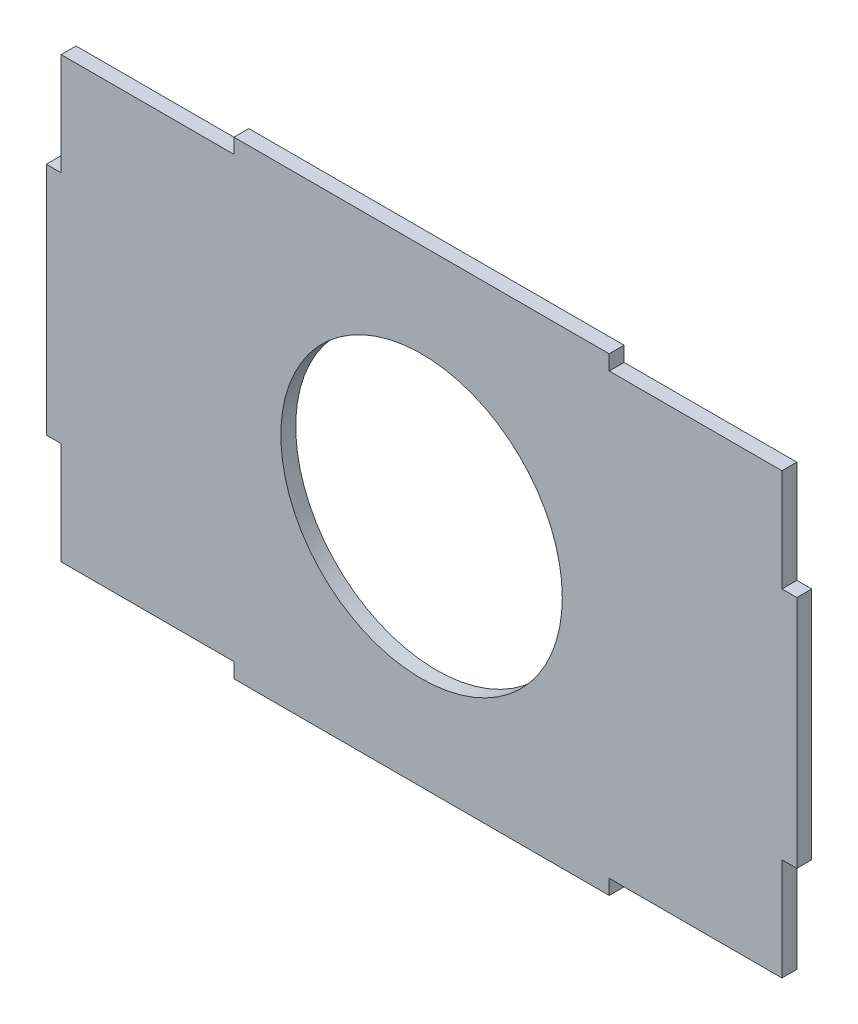
ISO-10303-21;
HEADER;
FILE_DESCRIPTION(('STEP AP214'),'2;1');
FILE_NAME('part.step','',(''),(''),'','','');
FILE_SCHEMA(('AUTOMOTIVE_DESIGN { 1 0 10303 214 1 1 1 1 }'));
ENDSEC;
DATA;
#1=APPLICATION_CONTEXT('core data for automotive mechanical design processes');
#2=APPLICATION_PROTOCOL_DEFINITION('international standard','automotive_design',2000,#1);
#3=PRODUCT_CONTEXT('',#1,'mechanical');
#4=PRODUCT('Part','Part','',(#3));
#5=PRODUCT_RELATED_PRODUCT_CATEGORY('part','',(#4));
#6=PRODUCT_DEFINITION_FORMATION('','',#4);
#7=PRODUCT_DEFINITION_CONTEXT('part definition',#1,'design');
#8=PRODUCT_DEFINITION('design','',#6,#7);
#9=PRODUCT_DEFINITION_SHAPE('','',#8);
#10=(LENGTH_UNIT() NAMED_UNIT(*) SI_UNIT(.MILLI.,.METRE.));
#11=(NAMED_UNIT(*) PLANE_ANGLE_UNIT() SI_UNIT($,.RADIAN.));
#12=(NAMED_UNIT(*) SI_UNIT($,.STERADIAN.) SOLID_ANGLE_UNIT());
#13=UNCERTAINTY_MEASURE_WITH_UNIT(LENGTH_MEASURE(1.E-05),#10,'distance_accuracy_value','');
#14=(GEOMETRIC_REPRESENTATION_CONTEXT(3) GLOBAL_UNCERTAINTY_ASSIGNED_CONTEXT((#13)) GLOBAL_UNIT_ASSIGNED_CONTEXT((#10,
#11,#12)) REPRESENTATION_CONTEXT('',''));
#15=CARTESIAN_POINT('',(0.,0.,0.));
#16=DIRECTION('',(0.,0.,1.));
#17=DIRECTION('',(1.,0.,0.));
#18=AXIS2_PLACEMENT_3D('',#15,#16,#17);
#19=CARTESIAN_POINT('',(-40.,96.825,3.175));
#20=DIRECTION('',(1.,0.,0.));
#21=DIRECTION('',(0.,1.,0.));
#22=AXIS2_PLACEMENT_3D('',#19,#20,#21);
#23=PLANE('',#22);
#24=DIRECTION('',(0.,-1.,0.));
#25=VECTOR('',#24,1.);
#26=CARTESIAN_POINT('',(-40.,96.825,0.));
#27=LINE('',#26,#25);
#28=CARTESIAN_POINT('',(-40.,100.,0.));
#29=VERTEX_POINT('',#28);
#30=CARTESIAN_POINT('',(-40.,96.825,0.));
#31=VERTEX_POINT('',#30);
#32=EDGE_CURVE('E201',#29,#31,#27,.T.);
#33=ORIENTED_EDGE('',*,*,#32,.T.);
#34=DIRECTION('',(0.,0.,-1.));
#35=VECTOR('',#34,1.);
#36=CARTESIAN_POINT('',(-40.,96.825,3.175));
#37=LINE('',#36,#35);
#38=CARTESIAN_POINT('',(-40.,96.825,3.175));
#39=VERTEX_POINT('',#38);
#40=EDGE_CURVE('E11',#39,#31,#37,.T.);
#41=ORIENTED_EDGE('',*,*,#40,.F.);
#42=DIRECTION('',(0.,-1.,0.));
#43=VECTOR('',#42,1.);
#44=CARTESIAN_POINT('',(-40.,96.825,3.175));
#45=LINE('',#44,#43);
#46=CARTESIAN_POINT('',(-40.,100.,3.175));
#47=VERTEX_POINT('',#46);
#48=EDGE_CURVE('E240',#47,#39,#45,.T.);
#49=ORIENTED_EDGE('',*,*,#48,.F.);
#50=DIRECTION('',(0.,0.,-1.));
#51=VECTOR('',#50,1.);
#52=CARTESIAN_POINT('',(-40.,100.,3.175));
#53=LINE('',#52,#51);
#54=EDGE_CURVE('E197',#47,#29,#53,.T.);
#55=ORIENTED_EDGE('',*,*,#54,.T.);
#56=EDGE_LOOP('',(#33,#41,#49,#55));
#57=FACE_BOUND('',#56,.T.);
#58=ADVANCED_FACE('F33',(#57),#23,.F.);
#59=CARTESIAN_POINT('',(-76.825,96.825,3.175));
#60=DIRECTION('',(0.,-1.,0.));
#61=DIRECTION('',(1.,0.,0.));
#62=AXIS2_PLACEMENT_3D('',#59,#60,#61);
#63=PLANE('',#62);
#64=DIRECTION('',(-1.,0.,0.));
#65=VECTOR('',#64,1.);
#66=CARTESIAN_POINT('',(-76.825,96.825,0.));
#67=LINE('',#66,#65);
#68=CARTESIAN_POINT('',(-76.825,96.825,0.));
#69=VERTEX_POINT('',#68);
#70=EDGE_CURVE('E204',#31,#69,#67,.T.);
#71=ORIENTED_EDGE('',*,*,#70,.T.);
#72=DIRECTION('',(0.,0.,-1.));
#73=VECTOR('',#72,1.);
#74=CARTESIAN_POINT('',(-76.825,96.825,3.175));
#75=LINE('',#74,#73);
#76=CARTESIAN_POINT('',(-76.825,96.825,3.175));
#77=VERTEX_POINT('',#76);
#78=EDGE_CURVE('E41',#77,#69,#75,.T.);
#79=ORIENTED_EDGE('',*,*,#78,.F.);
#80=DIRECTION('',(-1.,0.,0.));
#81=VECTOR('',#80,1.);
#82=CARTESIAN_POINT('',(-76.825,96.825,3.175));
#83=LINE('',#82,#81);
#84=EDGE_CURVE('E128',#39,#77,#83,.T.);
#85=ORIENTED_EDGE('',*,*,#84,.F.);
#86=ORIENTED_EDGE('',*,*,#40,.T.);
#87=EDGE_LOOP('',(#71,#79,#85,#86));
#88=FACE_BOUND('',#87,.T.);
#89=ADVANCED_FACE('F360',(#88),#63,.F.);
#90=CARTESIAN_POINT('',(-76.825,75.,3.175));
#91=DIRECTION('',(1.,0.,0.));
#92=DIRECTION('',(0.,1.,0.));
#93=AXIS2_PLACEMENT_3D('',#90,#91,#92);
#94=PLANE('',#93);
#95=DIRECTION('',(0.,-1.,0.));
#96=VECTOR('',#95,1.);
#97=CARTESIAN_POINT('',(-76.825,75.,0.));
#98=LINE('',#97,#96);
#99=CARTESIAN_POINT('',(-76.825,75.,0.));
#100=VERTEX_POINT('',#99);
#101=EDGE_CURVE('E207',#69,#100,#98,.T.);
#102=ORIENTED_EDGE('',*,*,#101,.T.);
#103=DIRECTION('',(0.,0.,-1.));
#104=VECTOR('',#103,1.);
#105=CARTESIAN_POINT('',(-76.825,75.,3.175));
#106=LINE('',#105,#104);
#107=CARTESIAN_POINT('',(-76.825,75.,3.175));
#108=VERTEX_POINT('',#107);
#109=EDGE_CURVE('E283',#108,#100,#106,.T.);
#110=ORIENTED_EDGE('',*,*,#109,.F.);
#111=DIRECTION('',(0.,-1.,0.));
#112=VECTOR('',#111,1.);
#113=CARTESIAN_POINT('',(-76.825,75.,3.175));
#114=LINE('',#113,#112);
#115=EDGE_CURVE('E291',#77,#108,#114,.T.);
#116=ORIENTED_EDGE('',*,*,#115,.F.);
#117=ORIENTED_EDGE('',*,*,#78,.T.);
#118=EDGE_LOOP('',(#102,#110,#116,#117));
#119=FACE_BOUND('',#118,.T.);
#120=ADVANCED_FACE('F289',(#119),#94,.F.);
#121=CARTESIAN_POINT('',(-80.,75.,3.175));
#122=DIRECTION('',(0.,-1.,0.));
#123=DIRECTION('',(1.,0.,0.));
#124=AXIS2_PLACEMENT_3D('',#121,#122,#123);
#125=PLANE('',#124);
#126=DIRECTION('',(-1.,0.,0.));
#127=VECTOR('',#126,1.);
#128=CARTESIAN_POINT('',(-80.,75.,0.));
#129=LINE('',#128,#127);
#130=CARTESIAN_POINT('',(-80.,75.,0.));
#131=VERTEX_POINT('',#130);
#132=EDGE_CURVE('E209',#100,#131,#129,.T.);
#133=ORIENTED_EDGE('',*,*,#132,.T.);
#134=DIRECTION('',(0.,0.,-1.));
#135=VECTOR('',#134,1.);
#136=CARTESIAN_POINT('',(-80.,75.,3.175));
#137=LINE('',#136,#135);
#138=CARTESIAN_POINT('',(-80.,75.,3.175));
#139=VERTEX_POINT('',#138);
#140=EDGE_CURVE('E280',#139,#131,#137,.T.);
#141=ORIENTED_EDGE('',*,*,#140,.F.);
#142=DIRECTION('',(-1.,0.,0.));
#143=VECTOR('',#142,1.);
#144=CARTESIAN_POINT('',(-80.,75.,3.175));
#145=LINE('',#144,#143);
#146=EDGE_CURVE('E309',#108,#139,#145,.T.);
#147=ORIENTED_EDGE('',*,*,#146,.F.);
#148=ORIENTED_EDGE('',*,*,#109,.T.);
#149=EDGE_LOOP('',(#133,#141,#147,#148));
#150=FACE_BOUND('',#149,.T.);
#151=ADVANCED_FACE('F300',(#150),#125,.F.);
#152=CARTESIAN_POINT('',(-80.,25.,3.175));
#153=DIRECTION('',(1.,0.,0.));
#154=DIRECTION('',(0.,0.,-1.));
#155=AXIS2_PLACEMENT_3D('',#152,#153,#154);
#156=PLANE('',#155);
#157=DIRECTION('',(0.,-1.,0.));
#158=VECTOR('',#157,1.);
#159=CARTESIAN_POINT('',(-80.,25.,0.));
#160=LINE('',#159,#158);
#161=CARTESIAN_POINT('',(-80.,25.,0.));
#162=VERTEX_POINT('',#161);
#163=EDGE_CURVE('E211',#131,#162,#160,.T.);
#164=ORIENTED_EDGE('',*,*,#163,.T.);
#165=DIRECTION('',(0.,0.,-1.));
#166=VECTOR('',#165,1.);
#167=CARTESIAN_POINT('',(-80.,25.,3.175));
#168=LINE('',#167,#166);
#169=CARTESIAN_POINT('',(-80.,25.,3.175));
#170=VERTEX_POINT('',#169);
#171=EDGE_CURVE('E277',#170,#162,#168,.T.);
#172=ORIENTED_EDGE('',*,*,#171,.F.);
#173=DIRECTION('',(0.,-1.,0.));
#174=VECTOR('',#173,1.);
#175=CARTESIAN_POINT('',(-80.,25.,3.175));
#176=LINE('',#175,#174);
#177=EDGE_CURVE('E306',#139,#170,#176,.T.);
#178=ORIENTED_EDGE('',*,*,#177,.F.);
#179=ORIENTED_EDGE('',*,*,#140,.T.);
#180=EDGE_LOOP('',(#164,#172,#178,#179));
#181=FACE_BOUND('',#180,.T.);
#182=ADVANCED_FACE('F304',(#181),#156,.F.);
#183=CARTESIAN_POINT('',(-76.825,25.,3.175));
#184=DIRECTION('',(0.,1.,0.));
#185=DIRECTION('',(-1.,0.,0.));
#186=AXIS2_PLACEMENT_3D('',#183,#184,#185);
#187=PLANE('',#186);
#188=DIRECTION('',(1.,0.,0.));
#189=VECTOR('',#188,1.);
#190=CARTESIAN_POINT('',(-76.825,25.,0.));
#191=LINE('',#190,#189);
#192=CARTESIAN_POINT('',(-76.825,25.,0.));
#193=VERTEX_POINT('',#192);
#194=EDGE_CURVE('E213',#162,#193,#191,.T.);
#195=ORIENTED_EDGE('',*,*,#194,.T.);
#196=DIRECTION('',(0.,0.,-1.));
#197=VECTOR('',#196,1.);
#198=CARTESIAN_POINT('',(-76.825,25.,3.175));
#199=LINE('',#198,#197);
#200=CARTESIAN_POINT('',(-76.825,25.,3.175));
#201=VERTEX_POINT('',#200);
#202=EDGE_CURVE('E274',#201,#193,#199,.T.);
#203=ORIENTED_EDGE('',*,*,#202,.F.);
#204=DIRECTION('',(1.,0.,0.));
#205=VECTOR('',#204,1.);
#206=CARTESIAN_POINT('',(-76.825,25.,3.175));
#207=LINE('',#206,#205);
#208=EDGE_CURVE('E308',#170,#201,#207,.T.);
#209=ORIENTED_EDGE('',*,*,#208,.F.);
#210=ORIENTED_EDGE('',*,*,#171,.T.);
#211=EDGE_LOOP('',(#195,#203,#209,#210));
#212=FACE_BOUND('',#211,.T.);
#213=ADVANCED_FACE('F373',(#212),#187,.F.);
#214=CARTESIAN_POINT('',(-76.825,3.175,3.175));
#215=DIRECTION('',(1.,0.,0.));
#216=DIRECTION('',(0.,1.,0.));
#217=AXIS2_PLACEMENT_3D('',#214,#215,#216);
#218=PLANE('',#217);
#219=DIRECTION('',(0.,-1.,0.));
#220=VECTOR('',#219,1.);
#221=CARTESIAN_POINT('',(-76.825,3.175,0.));
#222=LINE('',#221,#220);
#223=CARTESIAN_POINT('',(-76.825,3.175,0.));
#224=VERTEX_POINT('',#223);
#225=EDGE_CURVE('E215',#193,#224,#222,.T.);
#226=ORIENTED_EDGE('',*,*,#225,.T.);
#227=DIRECTION('',(0.,0.,-1.));
#228=VECTOR('',#227,1.);
#229=CARTESIAN_POINT('',(-76.825,3.175,3.175));
#230=LINE('',#229,#228);
#231=CARTESIAN_POINT('',(-76.825,3.175,3.175));
#232=VERTEX_POINT('',#231);
#233=EDGE_CURVE('E271',#232,#224,#230,.T.);
#234=ORIENTED_EDGE('',*,*,#233,.F.);
#235=DIRECTION('',(0.,-1.,0.));
#236=VECTOR('',#235,1.);
#237=CARTESIAN_POINT('',(-76.825,3.175,3.175));
#238=LINE('',#237,#236);
#239=EDGE_CURVE('E311',#201,#232,#238,.T.);
#240=ORIENTED_EDGE('',*,*,#239,.F.);
#241=ORIENTED_EDGE('',*,*,#202,.T.);
#242=EDGE_LOOP('',(#226,#234,#240,#241));
#243=FACE_BOUND('',#242,.T.);
#244=ADVANCED_FACE('F376',(#243),#218,.F.);
#245=CARTESIAN_POINT('',(-40.,3.175,3.175));
#246=DIRECTION('',(0.,1.,0.));
#247=DIRECTION('',(-1.,0.,0.));
#248=AXIS2_PLACEMENT_3D('',#245,#246,#247);
#249=PLANE('',#248);
#250=DIRECTION('',(1.,0.,0.));
#251=VECTOR('',#250,1.);
#252=CARTESIAN_POINT('',(-40.,3.175,0.));
#253=LINE('',#252,#251);
#254=CARTESIAN_POINT('',(-40.,3.175,0.));
#255=VERTEX_POINT('',#254);
#256=EDGE_CURVE('E217',#224,#255,#253,.T.);
#257=ORIENTED_EDGE('',*,*,#256,.T.);
#258=DIRECTION('',(0.,0.,-1.));
#259=VECTOR('',#258,1.);
#260=CARTESIAN_POINT('',(-40.,3.175,3.175));
#261=LINE('',#260,#259);
#262=CARTESIAN_POINT('',(-40.,3.175,3.175));
#263=VERTEX_POINT('',#262);
#264=EDGE_CURVE('E268',#263,#255,#261,.T.);
#265=ORIENTED_EDGE('',*,*,#264,.F.);
#266=DIRECTION('',(1.,0.,0.));
#267=VECTOR('',#266,1.);
#268=CARTESIAN_POINT('',(-40.,3.175,3.175));
#269=LINE('',#268,#267);
#270=EDGE_CURVE('E317',#232,#263,#269,.T.);
#271=ORIENTED_EDGE('',*,*,#270,.F.);
#272=ORIENTED_EDGE('',*,*,#233,.T.);
#273=EDGE_LOOP('',(#257,#265,#271,#272));
#274=FACE_BOUND('',#273,.T.);
#275=ADVANCED_FACE('F380',(#274),#249,.F.);
#276=CARTESIAN_POINT('',(-40.,0.,3.175));
#277=DIRECTION('',(1.,0.,0.));
#278=DIRECTION('',(0.,0.,-1.));
#279=AXIS2_PLACEMENT_3D('',#276,#277,#278);
#280=PLANE('',#279);
#281=DIRECTION('',(0.,-1.,0.));
#282=VECTOR('',#281,1.);
#283=CARTESIAN_POINT('',(-40.,0.,0.));
#284=LINE('',#283,#282);
#285=CARTESIAN_POINT('',(-40.,0.,0.));
#286=VERTEX_POINT('',#285);
#287=EDGE_CURVE('E219',#255,#286,#284,.T.);
#288=ORIENTED_EDGE('',*,*,#287,.T.);
#289=DIRECTION('',(0.,0.,-1.));
#290=VECTOR('',#289,1.);
#291=CARTESIAN_POINT('',(-40.,0.,3.175));
#292=LINE('',#291,#290);
#293=CARTESIAN_POINT('',(-40.,0.,3.175));
#294=VERTEX_POINT('',#293);
#295=EDGE_CURVE('E265',#294,#286,#292,.T.);
#296=ORIENTED_EDGE('',*,*,#295,.F.);
#297=DIRECTION('',(0.,-1.,0.));
#298=VECTOR('',#297,1.);
#299=CARTESIAN_POINT('',(-40.,0.,3.175));
#300=LINE('',#299,#298);
#301=EDGE_CURVE('E319',#263,#294,#300,.T.);
#302=ORIENTED_EDGE('',*,*,#301,.F.);
#303=ORIENTED_EDGE('',*,*,#264,.T.);
#304=EDGE_LOOP('',(#288,#296,#302,#303));
#305=FACE_BOUND('',#304,.T.);
#306=ADVANCED_FACE('F384',(#305),#280,.F.);
#307=CARTESIAN_POINT('',(-40.,0.,3.175));
#308=DIRECTION('',(0.,1.,0.));
#309=DIRECTION('',(0.,0.,1.));
#310=AXIS2_PLACEMENT_3D('',#307,#308,#309);
#311=PLANE('',#310);
#312=DIRECTION('',(1.,0.,0.));
#313=VECTOR('',#312,1.);
#314=CARTESIAN_POINT('',(-40.,0.,0.));
#315=LINE('',#314,#313);
#316=CARTESIAN_POINT('',(40.,0.,0.));
#317=VERTEX_POINT('',#316);
#318=EDGE_CURVE('E221',#286,#317,#315,.T.);
#319=ORIENTED_EDGE('',*,*,#318,.T.);
#320=DIRECTION('',(0.,0.,-1.));
#321=VECTOR('',#320,1.);
#322=CARTESIAN_POINT('',(40.,0.,3.175));
#323=LINE('',#322,#321);
#324=CARTESIAN_POINT('',(40.,0.,3.175));
#325=VERTEX_POINT('',#324);
#326=EDGE_CURVE('E262',#325,#317,#323,.T.);
#327=ORIENTED_EDGE('',*,*,#326,.F.);
#328=DIRECTION('',(1.,0.,0.));
#329=VECTOR('',#328,1.);
#330=CARTESIAN_POINT('',(-40.,0.,3.175));
#331=LINE('',#330,#329);
#332=EDGE_CURVE('E321',#294,#325,#331,.T.);
#333=ORIENTED_EDGE('',*,*,#332,.F.);
#334=ORIENTED_EDGE('',*,*,#295,.T.);
#335=EDGE_LOOP('',(#319,#327,#333,#334));
#336=FACE_BOUND('',#335,.T.);
#337=ADVANCED_FACE('F388',(#336),#311,.F.);
#338=CARTESIAN_POINT('',(40.,0.,3.175));
#339=DIRECTION('',(-1.,0.,0.));
#340=DIRECTION('',(0.,0.,1.));
#341=AXIS2_PLACEMENT_3D('',#338,#339,#340);
#342=PLANE('',#341);
#343=DIRECTION('',(0.,1.,0.));
#344=VECTOR('',#343,1.);
#345=CARTESIAN_POINT('',(40.,0.,0.));
#346=LINE('',#345,#344);
#347=CARTESIAN_POINT('',(40.,3.175,0.));
#348=VERTEX_POINT('',#347);
#349=EDGE_CURVE('E223',#317,#348,#346,.T.);
#350=ORIENTED_EDGE('',*,*,#349,.T.);
#351=DIRECTION('',(0.,0.,-1.));
#352=VECTOR('',#351,1.);
#353=CARTESIAN_POINT('',(40.,3.175,3.175));
#354=LINE('',#353,#352);
#355=CARTESIAN_POINT('',(40.,3.175,3.175));
#356=VERTEX_POINT('',#355);
#357=EDGE_CURVE('E259',#356,#348,#354,.T.);
#358=ORIENTED_EDGE('',*,*,#357,.F.);
#359=DIRECTION('',(0.,1.,0.));
#360=VECTOR('',#359,1.);
#361=CARTESIAN_POINT('',(40.,0.,3.175));
#362=LINE('',#361,#360);
#363=EDGE_CURVE('E323',#325,#356,#362,.T.);
#364=ORIENTED_EDGE('',*,*,#363,.F.);
#365=ORIENTED_EDGE('',*,*,#326,.T.);
#366=EDGE_LOOP('',(#350,#358,#364,#365));
#367=FACE_BOUND('',#366,.T.);
#368=ADVANCED_FACE('F392',(#367),#342,.F.);
#369=CARTESIAN_POINT('',(40.,3.175,3.175));
#370=DIRECTION('',(0.,1.,0.));
#371=DIRECTION('',(-1.,0.,0.));
#372=AXIS2_PLACEMENT_3D('',#369,#370,#371);
#373=PLANE('',#372);
#374=DIRECTION('',(1.,0.,0.));
#375=VECTOR('',#374,1.);
#376=CARTESIAN_POINT('',(40.,3.175,0.));
#377=LINE('',#376,#375);
#378=CARTESIAN_POINT('',(76.825,3.175,0.));
#379=VERTEX_POINT('',#378);
#380=EDGE_CURVE('E225',#348,#379,#377,.T.);
#381=ORIENTED_EDGE('',*,*,#380,.T.);
#382=DIRECTION('',(0.,0.,-1.));
#383=VECTOR('',#382,1.);
#384=CARTESIAN_POINT('',(76.825,3.175,3.175));
#385=LINE('',#384,#383);
#386=CARTESIAN_POINT('',(76.825,3.175,3.175));
#387=VERTEX_POINT('',#386);
#388=EDGE_CURVE('E256',#387,#379,#385,.T.);
#389=ORIENTED_EDGE('',*,*,#388,.F.);
#390=DIRECTION('',(1.,0.,0.));
#391=VECTOR('',#390,1.);
#392=CARTESIAN_POINT('',(40.,3.175,3.175));
#393=LINE('',#392,#391);
#394=EDGE_CURVE('E325',#356,#387,#393,.T.);
#395=ORIENTED_EDGE('',*,*,#394,.F.);
#396=ORIENTED_EDGE('',*,*,#357,.T.);
#397=EDGE_LOOP('',(#381,#389,#395,#396));
#398=FACE_BOUND('',#397,.T.);
#399=ADVANCED_FACE('F396',(#398),#373,.F.);
#400=CARTESIAN_POINT('',(76.825,3.175,3.175));
#401=DIRECTION('',(-1.,0.,0.));
#402=DIRECTION('',(0.,0.,1.));
#403=AXIS2_PLACEMENT_3D('',#400,#401,#402);
#404=PLANE('',#403);
#405=DIRECTION('',(0.,1.,0.));
#406=VECTOR('',#405,1.);
#407=CARTESIAN_POINT('',(76.825,3.175,0.));
#408=LINE('',#407,#406);
#409=CARTESIAN_POINT('',(76.825,25.,0.));
#410=VERTEX_POINT('',#409);
#411=EDGE_CURVE('E227',#379,#410,#408,.T.);
#412=ORIENTED_EDGE('',*,*,#411,.T.);
#413=DIRECTION('',(0.,0.,-1.));
#414=VECTOR('',#413,1.);
#415=CARTESIAN_POINT('',(76.825,25.,3.175));
#416=LINE('',#415,#414);
#417=CARTESIAN_POINT('',(76.825,25.,3.175));
#418=VERTEX_POINT('',#417);
#419=EDGE_CURVE('E253',#418,#410,#416,.T.);
#420=ORIENTED_EDGE('',*,*,#419,.F.);
#421=DIRECTION('',(0.,1.,0.));
#422=VECTOR('',#421,1.);
#423=CARTESIAN_POINT('',(76.825,3.175,3.175));
#424=LINE('',#423,#422);
#425=EDGE_CURVE('E327',#387,#418,#424,.T.);
#426=ORIENTED_EDGE('',*,*,#425,.F.);
#427=ORIENTED_EDGE('',*,*,#388,.T.);
#428=EDGE_LOOP('',(#412,#420,#426,#427));
#429=FACE_BOUND('',#428,.T.);
#430=ADVANCED_FACE('F400',(#429),#404,.F.);
#431=CARTESIAN_POINT('',(76.825,25.,3.175));
#432=DIRECTION('',(0.,1.,0.));
#433=DIRECTION('',(0.,0.,1.));
#434=AXIS2_PLACEMENT_3D('',#431,#432,#433);
#435=PLANE('',#434);
#436=DIRECTION('',(1.,0.,0.));
#437=VECTOR('',#436,1.);
#438=CARTESIAN_POINT('',(76.825,25.,0.));
#439=LINE('',#438,#437);
#440=CARTESIAN_POINT('',(80.,25.,0.));
#441=VERTEX_POINT('',#440);
#442=EDGE_CURVE('E229',#410,#441,#439,.T.);
#443=ORIENTED_EDGE('',*,*,#442,.T.);
#444=DIRECTION('',(0.,0.,-1.));
#445=VECTOR('',#444,1.);
#446=CARTESIAN_POINT('',(80.,25.,3.175));
#447=LINE('',#446,#445);
#448=CARTESIAN_POINT('',(80.,25.,3.175));
#449=VERTEX_POINT('',#448);
#450=EDGE_CURVE('E250',#449,#441,#447,.T.);
#451=ORIENTED_EDGE('',*,*,#450,.F.);
#452=DIRECTION('',(1.,0.,0.));
#453=VECTOR('',#452,1.);
#454=CARTESIAN_POINT('',(76.825,25.,3.175));
#455=LINE('',#454,#453);
#456=EDGE_CURVE('E329',#418,#449,#455,.T.);
#457=ORIENTED_EDGE('',*,*,#456,.F.);
#458=ORIENTED_EDGE('',*,*,#419,.T.);
#459=EDGE_LOOP('',(#443,#451,#457,#458));
#460=FACE_BOUND('',#459,.T.);
#461=ADVANCED_FACE('F404',(#460),#435,.F.);
#462=CARTESIAN_POINT('',(80.,25.,3.175));
#463=DIRECTION('',(-1.,0.,0.));
#464=DIRECTION('',(0.,0.,1.));
#465=AXIS2_PLACEMENT_3D('',#462,#463,#464);
#466=PLANE('',#465);
#467=DIRECTION('',(0.,1.,0.));
#468=VECTOR('',#467,1.);
#469=CARTESIAN_POINT('',(80.,25.,0.));
#470=LINE('',#469,#468);
#471=CARTESIAN_POINT('',(80.,75.,0.));
#472=VERTEX_POINT('',#471);
#473=EDGE_CURVE('E231',#441,#472,#470,.T.);
#474=ORIENTED_EDGE('',*,*,#473,.T.);
#475=DIRECTION('',(0.,0.,-1.));
#476=VECTOR('',#475,1.);
#477=CARTESIAN_POINT('',(80.,75.,3.175));
#478=LINE('',#477,#476);
#479=CARTESIAN_POINT('',(80.,75.,3.175));
#480=VERTEX_POINT('',#479);
#481=EDGE_CURVE('E247',#480,#472,#478,.T.);
#482=ORIENTED_EDGE('',*,*,#481,.F.);
#483=DIRECTION('',(0.,1.,0.));
#484=VECTOR('',#483,1.);
#485=CARTESIAN_POINT('',(80.,25.,3.175));
#486=LINE('',#485,#484);
#487=EDGE_CURVE('E331',#449,#480,#486,.T.);
#488=ORIENTED_EDGE('',*,*,#487,.F.);
#489=ORIENTED_EDGE('',*,*,#450,.T.);
#490=EDGE_LOOP('',(#474,#482,#488,#489));
#491=FACE_BOUND('',#490,.T.);
#492=ADVANCED_FACE('F408',(#491),#466,.F.);
#493=CARTESIAN_POINT('',(80.,75.,3.175));
#494=DIRECTION('',(0.,-1.,0.));
#495=DIRECTION('',(1.,0.,0.));
#496=AXIS2_PLACEMENT_3D('',#493,#494,#495);
#497=PLANE('',#496);
#498=DIRECTION('',(-1.,0.,0.));
#499=VECTOR('',#498,1.);
#500=CARTESIAN_POINT('',(80.,75.,0.));
#501=LINE('',#500,#499);
#502=CARTESIAN_POINT('',(76.825,75.,0.));
#503=VERTEX_POINT('',#502);
#504=EDGE_CURVE('E233',#472,#503,#501,.T.);
#505=ORIENTED_EDGE('',*,*,#504,.T.);
#506=DIRECTION('',(0.,0.,-1.));
#507=VECTOR('',#506,1.);
#508=CARTESIAN_POINT('',(76.825,75.,3.175));
#509=LINE('',#508,#507);
#510=CARTESIAN_POINT('',(76.825,75.,3.175));
#511=VERTEX_POINT('',#510);
#512=EDGE_CURVE('E244',#511,#503,#509,.T.);
#513=ORIENTED_EDGE('',*,*,#512,.F.);
#514=DIRECTION('',(-1.,0.,0.));
#515=VECTOR('',#514,1.);
#516=CARTESIAN_POINT('',(80.,75.,3.175));
#517=LINE('',#516,#515);
#518=EDGE_CURVE('E333',#480,#511,#517,.T.);
#519=ORIENTED_EDGE('',*,*,#518,.F.);
#520=ORIENTED_EDGE('',*,*,#481,.T.);
#521=EDGE_LOOP('',(#505,#513,#519,#520));
#522=FACE_BOUND('',#521,.T.);
#523=ADVANCED_FACE('F339',(#522),#497,.F.);
#524=CARTESIAN_POINT('',(76.825,75.,3.175));
#525=DIRECTION('',(-1.,0.,0.));
#526=DIRECTION('',(0.,0.,1.));
#527=AXIS2_PLACEMENT_3D('',#524,#525,#526);
#528=PLANE('',#527);
#529=DIRECTION('',(0.,1.,0.));
#530=VECTOR('',#529,1.);
#531=CARTESIAN_POINT('',(76.825,75.,0.));
#532=LINE('',#531,#530);
#533=CARTESIAN_POINT('',(76.825,96.825,0.));
#534=VERTEX_POINT('',#533);
#535=EDGE_CURVE('E235',#503,#534,#532,.T.);
#536=ORIENTED_EDGE('',*,*,#535,.T.);
#537=DIRECTION('',(0.,0.,-1.));
#538=VECTOR('',#537,1.);
#539=CARTESIAN_POINT('',(76.825,96.825,3.175));
#540=LINE('',#539,#538);
#541=CARTESIAN_POINT('',(76.825,96.825,3.175));
#542=VERTEX_POINT('',#541);
#543=EDGE_CURVE('E192',#542,#534,#540,.T.);
#544=ORIENTED_EDGE('',*,*,#543,.F.);
#545=DIRECTION('',(0.,1.,0.));
#546=VECTOR('',#545,1.);
#547=CARTESIAN_POINT('',(76.825,75.,3.175));
#548=LINE('',#547,#546);
#549=EDGE_CURVE('E183',#511,#542,#548,.T.);
#550=ORIENTED_EDGE('',*,*,#549,.F.);
#551=ORIENTED_EDGE('',*,*,#512,.T.);
#552=EDGE_LOOP('',(#536,#544,#550,#551));
#553=FACE_BOUND('',#552,.T.);
#554=ADVANCED_FACE('F343',(#553),#528,.F.);
#555=CARTESIAN_POINT('',(76.825,96.825,3.175));
#556=DIRECTION('',(0.,-1.,0.));
#557=DIRECTION('',(1.,0.,0.));
#558=AXIS2_PLACEMENT_3D('',#555,#556,#557);
#559=PLANE('',#558);
#560=DIRECTION('',(-1.,0.,0.));
#561=VECTOR('',#560,1.);
#562=CARTESIAN_POINT('',(76.825,96.825,0.));
#563=LINE('',#562,#561);
#564=CARTESIAN_POINT('',(40.,96.825,0.));
#565=VERTEX_POINT('',#564);
#566=EDGE_CURVE('E191',#534,#565,#563,.T.);
#567=ORIENTED_EDGE('',*,*,#566,.T.);
#568=DIRECTION('',(0.,0.,-1.));
#569=VECTOR('',#568,1.);
#570=CARTESIAN_POINT('',(40.,96.825,3.175));
#571=LINE('',#570,#569);
#572=CARTESIAN_POINT('',(40.,96.825,3.175));
#573=VERTEX_POINT('',#572);
#574=EDGE_CURVE('E188',#573,#565,#571,.T.);
#575=ORIENTED_EDGE('',*,*,#574,.F.);
#576=DIRECTION('',(-1.,0.,0.));
#577=VECTOR('',#576,1.);
#578=CARTESIAN_POINT('',(76.825,96.825,3.175));
#579=LINE('',#578,#577);
#580=EDGE_CURVE('E177',#542,#573,#579,.T.);
#581=ORIENTED_EDGE('',*,*,#580,.F.);
#582=ORIENTED_EDGE('',*,*,#543,.T.);
#583=EDGE_LOOP('',(#567,#575,#581,#582));
#584=FACE_BOUND('',#583,.T.);
#585=ADVANCED_FACE('F189',(#584),#559,.F.);
#586=CARTESIAN_POINT('',(40.,96.825,3.175));
#587=DIRECTION('',(-1.,0.,0.));
#588=DIRECTION('',(0.,-1.,0.));
#589=AXIS2_PLACEMENT_3D('',#586,#587,#588);
#590=PLANE('',#589);
#591=DIRECTION('',(0.,1.,0.));
#592=VECTOR('',#591,1.);
#593=CARTESIAN_POINT('',(40.,96.825,0.));
#594=LINE('',#593,#592);
#595=CARTESIAN_POINT('',(40.,100.,0.));
#596=VERTEX_POINT('',#595);
#597=EDGE_CURVE('E114',#565,#596,#594,.T.);
#598=ORIENTED_EDGE('',*,*,#597,.T.);
#599=DIRECTION('',(0.,0.,-1.));
#600=VECTOR('',#599,1.);
#601=CARTESIAN_POINT('',(40.,100.,3.175));
#602=LINE('',#601,#600);
#603=CARTESIAN_POINT('',(40.,100.,3.175));
#604=VERTEX_POINT('',#603);
#605=EDGE_CURVE('E193',#604,#596,#602,.T.);
#606=ORIENTED_EDGE('',*,*,#605,.F.);
#607=DIRECTION('',(0.,1.,0.));
#608=VECTOR('',#607,1.);
#609=CARTESIAN_POINT('',(40.,96.825,3.175));
#610=LINE('',#609,#608);
#611=EDGE_CURVE('E181',#573,#604,#610,.T.);
#612=ORIENTED_EDGE('',*,*,#611,.F.);
#613=ORIENTED_EDGE('',*,*,#574,.T.);
#614=EDGE_LOOP('',(#598,#606,#612,#613));
#615=FACE_BOUND('',#614,.T.);
#616=ADVANCED_FACE('F195',(#615),#590,.F.);
#617=CARTESIAN_POINT('',(40.,100.,3.175));
#618=DIRECTION('',(0.,-1.,0.));
#619=DIRECTION('',(1.,0.,0.));
#620=AXIS2_PLACEMENT_3D('',#617,#618,#619);
#621=PLANE('',#620);
#622=DIRECTION('',(-1.,0.,0.));
#623=VECTOR('',#622,1.);
#624=CARTESIAN_POINT('',(40.,100.,0.));
#625=LINE('',#624,#623);
#626=EDGE_CURVE('E120',#596,#29,#625,.T.);
#627=ORIENTED_EDGE('',*,*,#626,.T.);
#628=ORIENTED_EDGE('',*,*,#54,.F.);
#629=DIRECTION('',(-1.,0.,0.));
#630=VECTOR('',#629,1.);
#631=CARTESIAN_POINT('',(40.,100.,3.175));
#632=LINE('',#631,#630);
#633=EDGE_CURVE('E49',#604,#47,#632,.T.);
#634=ORIENTED_EDGE('',*,*,#633,.F.);
#635=ORIENTED_EDGE('',*,*,#605,.T.);
#636=EDGE_LOOP('',(#627,#628,#634,#635));
#637=FACE_BOUND('',#636,.T.);
#638=ADVANCED_FACE('F347',(#637),#621,.F.);
#639=CARTESIAN_POINT('',(0.,0.,3.175));
#640=DIRECTION('',(0.,0.,1.));
#641=DIRECTION('',(1.,0.,0.));
#642=AXIS2_PLACEMENT_3D('',#639,#640,#641);
#643=PLANE('',#642);
#644=CARTESIAN_POINT('',(0.,50.,3.175));
#645=DIRECTION('',(0.,0.,1.));
#646=DIRECTION('',(1.,0.,0.));
#647=AXIS2_PLACEMENT_3D('',#644,#645,#646);
#648=CIRCLE('',#647,30.);
#649=CARTESIAN_POINT('',(30.,50.,3.175));
#650=VERTEX_POINT('',#649);
#651=EDGE_CURVE('E462',#650,#650,#648,.T.);
#652=ORIENTED_EDGE('',*,*,#651,.F.);
#653=EDGE_LOOP('',(#652));
#654=FACE_BOUND('',#653,.T.);
#655=ORIENTED_EDGE('',*,*,#48,.T.);
#656=ORIENTED_EDGE('',*,*,#84,.T.);
#657=ORIENTED_EDGE('',*,*,#115,.T.);
#658=ORIENTED_EDGE('',*,*,#146,.T.);
#659=ORIENTED_EDGE('',*,*,#177,.T.);
#660=ORIENTED_EDGE('',*,*,#208,.T.);
#661=ORIENTED_EDGE('',*,*,#239,.T.);
#662=ORIENTED_EDGE('',*,*,#270,.T.);
#663=ORIENTED_EDGE('',*,*,#301,.T.);
#664=ORIENTED_EDGE('',*,*,#332,.T.);
#665=ORIENTED_EDGE('',*,*,#363,.T.);
#666=ORIENTED_EDGE('',*,*,#394,.T.);
#667=ORIENTED_EDGE('',*,*,#425,.T.);
#668=ORIENTED_EDGE('',*,*,#456,.T.);
#669=ORIENTED_EDGE('',*,*,#487,.T.);
#670=ORIENTED_EDGE('',*,*,#518,.T.);
#671=ORIENTED_EDGE('',*,*,#549,.T.);
#672=ORIENTED_EDGE('',*,*,#580,.T.);
#673=ORIENTED_EDGE('',*,*,#611,.T.);
#674=ORIENTED_EDGE('',*,*,#633,.T.);
#675=EDGE_LOOP('',(#655,#656,#657,#658,#659,#660,#661,#662,#663,#664,#665,#666,#667,#668,#669,
#670,#671,#672,#673,#674));
#676=FACE_BOUND('',#675,.T.);
#677=ADVANCED_FACE('F179',(#654,#676),#643,.T.);
#678=CARTESIAN_POINT('',(0.,0.,0.));
#679=DIRECTION('',(0.,0.,1.));
#680=DIRECTION('',(1.,0.,0.));
#681=AXIS2_PLACEMENT_3D('',#678,#679,#680);
#682=PLANE('',#681);
#683=CARTESIAN_POINT('',(0.,50.,0.));
#684=DIRECTION('',(0.,0.,1.));
#685=DIRECTION('',(1.,0.,0.));
#686=AXIS2_PLACEMENT_3D('',#683,#684,#685);
#687=CIRCLE('',#686,30.);
#688=CARTESIAN_POINT('',(30.,50.,0.));
#689=VERTEX_POINT('',#688);
#690=EDGE_CURVE('E205',#689,#689,#687,.T.);
#691=ORIENTED_EDGE('',*,*,#690,.T.);
#692=EDGE_LOOP('',(#691));
#693=FACE_BOUND('',#692,.T.);
#694=ORIENTED_EDGE('',*,*,#32,.F.);
#695=ORIENTED_EDGE('',*,*,#626,.F.);
#696=ORIENTED_EDGE('',*,*,#597,.F.);
#697=ORIENTED_EDGE('',*,*,#566,.F.);
#698=ORIENTED_EDGE('',*,*,#535,.F.);
#699=ORIENTED_EDGE('',*,*,#504,.F.);
#700=ORIENTED_EDGE('',*,*,#473,.F.);
#701=ORIENTED_EDGE('',*,*,#442,.F.);
#702=ORIENTED_EDGE('',*,*,#411,.F.);
#703=ORIENTED_EDGE('',*,*,#380,.F.);
#704=ORIENTED_EDGE('',*,*,#349,.F.);
#705=ORIENTED_EDGE('',*,*,#318,.F.);
#706=ORIENTED_EDGE('',*,*,#287,.F.);
#707=ORIENTED_EDGE('',*,*,#256,.F.);
#708=ORIENTED_EDGE('',*,*,#225,.F.);
#709=ORIENTED_EDGE('',*,*,#194,.F.);
#710=ORIENTED_EDGE('',*,*,#163,.F.);
#711=ORIENTED_EDGE('',*,*,#132,.F.);
#712=ORIENTED_EDGE('',*,*,#101,.F.);
#713=ORIENTED_EDGE('',*,*,#70,.F.);
#714=EDGE_LOOP('',(#694,#695,#696,#697,#698,#699,#700,#701,#702,#703,#704,#705,#706,#707,#708,
#709,#710,#711,#712,#713));
#715=FACE_BOUND('',#714,.T.);
#716=ADVANCED_FACE('F295',(#693,#715),#682,.F.);
#717=CARTESIAN_POINT('',(0.,50.,0.));
#718=DIRECTION('',(0.,0.,1.));
#719=DIRECTION('',(1.,0.,0.));
#720=AXIS2_PLACEMENT_3D('',#717,#718,#719);
#721=CYLINDRICAL_SURFACE('',#720,30.);
#722=ORIENTED_EDGE('',*,*,#690,.F.);
#723=EDGE_LOOP('',(#722));
#724=FACE_BOUND('',#723,.T.);
#725=ORIENTED_EDGE('',*,*,#651,.T.);
#726=EDGE_LOOP('',(#725));
#727=FACE_BOUND('',#726,.T.);
#728=ADVANCED_FACE('F441',(#724,#727),#721,.F.);
#729=CLOSED_SHELL('',(#58,#89,#120,#151,#182,#213,#244,#275,#306,#337,#368,#399,#430,#461,#492,
#523,#554,#585,#616,#638,#677,#716,#728));
#730=MANIFOLD_SOLID_BREP('B2',#729);
#731=ADVANCED_BREP_SHAPE_REPRESENTATION('',(#18,#730),#14);
#732=SHAPE_DEFINITION_REPRESENTATION(#9,#731);
ENDSEC;
END-ISO-10303-21;
